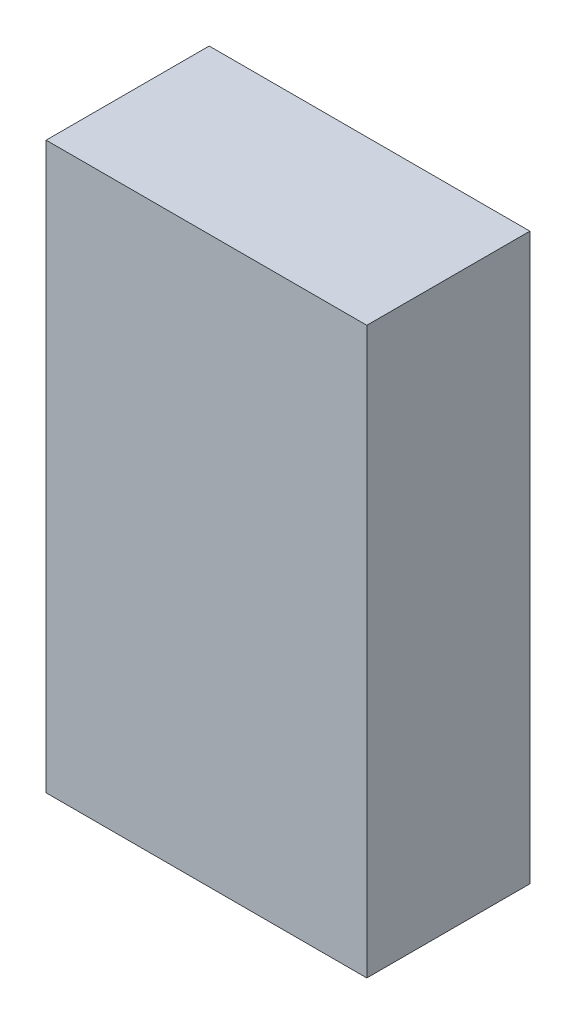
ISO-10303-21;
HEADER;
FILE_DESCRIPTION(('STEP AP214'),'2;1');
FILE_NAME('part.step','',(''),(''),'','','');
FILE_SCHEMA(('AUTOMOTIVE_DESIGN { 1 0 10303 214 1 1 1 1 }'));
ENDSEC;
DATA;
#1=APPLICATION_CONTEXT('core data for automotive mechanical design processes');
#2=APPLICATION_PROTOCOL_DEFINITION('international standard','automotive_design',2000,#1);
#3=PRODUCT_CONTEXT('',#1,'mechanical');
#4=PRODUCT('Part','Part','',(#3));
#5=PRODUCT_RELATED_PRODUCT_CATEGORY('part','',(#4));
#6=PRODUCT_DEFINITION_FORMATION('','',#4);
#7=PRODUCT_DEFINITION_CONTEXT('part definition',#1,'design');
#8=PRODUCT_DEFINITION('design','',#6,#7);
#9=PRODUCT_DEFINITION_SHAPE('','',#8);
#10=(LENGTH_UNIT() NAMED_UNIT(*) SI_UNIT(.MILLI.,.METRE.));
#11=(NAMED_UNIT(*) PLANE_ANGLE_UNIT() SI_UNIT($,.RADIAN.));
#12=(NAMED_UNIT(*) SI_UNIT($,.STERADIAN.) SOLID_ANGLE_UNIT());
#13=UNCERTAINTY_MEASURE_WITH_UNIT(LENGTH_MEASURE(1.E-05),#10,'distance_accuracy_value','');
#14=(GEOMETRIC_REPRESENTATION_CONTEXT(3) GLOBAL_UNCERTAINTY_ASSIGNED_CONTEXT((#13)) GLOBAL_UNIT_ASSIGNED_CONTEXT((#10,
#11,#12)) REPRESENTATION_CONTEXT('',''));
#15=CARTESIAN_POINT('',(0.,0.,0.));
#16=DIRECTION('',(0.,0.,1.));
#17=DIRECTION('',(1.,0.,0.));
#18=AXIS2_PLACEMENT_3D('',#15,#16,#17);
#19=CARTESIAN_POINT('',(-374.65,1320.8,190.5));
#20=DIRECTION('',(1.,0.,0.));
#21=DIRECTION('',(0.,0.,-1.));
#22=AXIS2_PLACEMENT_3D('',#19,#20,#21);
#23=PLANE('',#22);
#24=DIRECTION('',(0.,0.,1.));
#25=VECTOR('',#24,1.);
#26=CARTESIAN_POINT('',(-374.65,0.,190.5));
#27=LINE('',#26,#25);
#28=CARTESIAN_POINT('',(-374.65,0.,-190.5));
#29=VERTEX_POINT('',#28);
#30=CARTESIAN_POINT('',(-374.65,0.,190.5));
#31=VERTEX_POINT('',#30);
#32=EDGE_CURVE('E98',#29,#31,#27,.T.);
#33=ORIENTED_EDGE('',*,*,#32,.T.);
#34=DIRECTION('',(0.,-1.,0.));
#35=VECTOR('',#34,1.);
#36=CARTESIAN_POINT('',(-374.65,1320.8,190.5));
#37=LINE('',#36,#35);
#38=CARTESIAN_POINT('',(-374.65,1320.8,190.5));
#39=VERTEX_POINT('',#38);
#40=EDGE_CURVE('E11',#39,#31,#37,.T.);
#41=ORIENTED_EDGE('',*,*,#40,.F.);
#42=DIRECTION('',(0.,0.,1.));
#43=VECTOR('',#42,1.);
#44=CARTESIAN_POINT('',(-374.65,1320.8,190.5));
#45=LINE('',#44,#43);
#46=CARTESIAN_POINT('',(-374.65,1320.8,-190.5));
#47=VERTEX_POINT('',#46);
#48=EDGE_CURVE('E86',#47,#39,#45,.T.);
#49=ORIENTED_EDGE('',*,*,#48,.F.);
#50=DIRECTION('',(0.,-1.,0.));
#51=VECTOR('',#50,1.);
#52=CARTESIAN_POINT('',(-374.65,1320.8,-190.5));
#53=LINE('',#52,#51);
#54=EDGE_CURVE('E94',#47,#29,#53,.T.);
#55=ORIENTED_EDGE('',*,*,#54,.T.);
#56=EDGE_LOOP('',(#33,#41,#49,#55));
#57=FACE_BOUND('',#56,.T.);
#58=ADVANCED_FACE('F35',(#57),#23,.F.);
#59=CARTESIAN_POINT('',(374.65,1320.8,190.5));
#60=DIRECTION('',(0.,0.,-1.));
#61=DIRECTION('',(-1.,0.,0.));
#62=AXIS2_PLACEMENT_3D('',#59,#60,#61);
#63=PLANE('',#62);
#64=DIRECTION('',(1.,0.,0.));
#65=VECTOR('',#64,1.);
#66=CARTESIAN_POINT('',(374.65,0.,190.5));
#67=LINE('',#66,#65);
#68=CARTESIAN_POINT('',(374.65,0.,190.5));
#69=VERTEX_POINT('',#68);
#70=EDGE_CURVE('E90',#31,#69,#67,.T.);
#71=ORIENTED_EDGE('',*,*,#70,.T.);
#72=DIRECTION('',(0.,-1.,0.));
#73=VECTOR('',#72,1.);
#74=CARTESIAN_POINT('',(374.65,1320.8,190.5));
#75=LINE('',#74,#73);
#76=CARTESIAN_POINT('',(374.65,1320.8,190.5));
#77=VERTEX_POINT('',#76);
#78=EDGE_CURVE('E43',#77,#69,#75,.T.);
#79=ORIENTED_EDGE('',*,*,#78,.F.);
#80=DIRECTION('',(1.,0.,0.));
#81=VECTOR('',#80,1.);
#82=CARTESIAN_POINT('',(374.65,1320.8,190.5));
#83=LINE('',#82,#81);
#84=EDGE_CURVE('E81',#39,#77,#83,.T.);
#85=ORIENTED_EDGE('',*,*,#84,.F.);
#86=ORIENTED_EDGE('',*,*,#40,.T.);
#87=EDGE_LOOP('',(#71,#79,#85,#86));
#88=FACE_BOUND('',#87,.T.);
#89=ADVANCED_FACE('F89',(#88),#63,.F.);
#90=CARTESIAN_POINT('',(374.65,1320.8,190.5));
#91=DIRECTION('',(-1.,0.,0.));
#92=DIRECTION('',(0.,0.,1.));
#93=AXIS2_PLACEMENT_3D('',#90,#91,#92);
#94=PLANE('',#93);
#95=DIRECTION('',(0.,0.,-1.));
#96=VECTOR('',#95,1.);
#97=CARTESIAN_POINT('',(374.65,0.,190.5));
#98=LINE('',#97,#96);
#99=CARTESIAN_POINT('',(374.65,0.,-190.5));
#100=VERTEX_POINT('',#99);
#101=EDGE_CURVE('E68',#69,#100,#98,.T.);
#102=ORIENTED_EDGE('',*,*,#101,.T.);
#103=DIRECTION('',(0.,-1.,0.));
#104=VECTOR('',#103,1.);
#105=CARTESIAN_POINT('',(374.65,1320.8,-190.5));
#106=LINE('',#105,#104);
#107=CARTESIAN_POINT('',(374.65,1320.8,-190.5));
#108=VERTEX_POINT('',#107);
#109=EDGE_CURVE('E91',#108,#100,#106,.T.);
#110=ORIENTED_EDGE('',*,*,#109,.F.);
#111=DIRECTION('',(0.,0.,-1.));
#112=VECTOR('',#111,1.);
#113=CARTESIAN_POINT('',(374.65,1320.8,190.5));
#114=LINE('',#113,#112);
#115=EDGE_CURVE('E84',#77,#108,#114,.T.);
#116=ORIENTED_EDGE('',*,*,#115,.F.);
#117=ORIENTED_EDGE('',*,*,#78,.T.);
#118=EDGE_LOOP('',(#102,#110,#116,#117));
#119=FACE_BOUND('',#118,.T.);
#120=ADVANCED_FACE('F92',(#119),#94,.F.);
#121=CARTESIAN_POINT('',(374.65,1320.8,-190.5));
#122=DIRECTION('',(0.,0.,1.));
#123=DIRECTION('',(1.,0.,0.));
#124=AXIS2_PLACEMENT_3D('',#121,#122,#123);
#125=PLANE('',#124);
#126=DIRECTION('',(-1.,0.,0.));
#127=VECTOR('',#126,1.);
#128=CARTESIAN_POINT('',(374.65,0.,-190.5));
#129=LINE('',#128,#127);
#130=EDGE_CURVE('E74',#100,#29,#129,.T.);
#131=ORIENTED_EDGE('',*,*,#130,.T.);
#132=ORIENTED_EDGE('',*,*,#54,.F.);
#133=DIRECTION('',(-1.,0.,0.));
#134=VECTOR('',#133,1.);
#135=CARTESIAN_POINT('',(374.65,1320.8,-190.5));
#136=LINE('',#135,#134);
#137=EDGE_CURVE('E51',#108,#47,#136,.T.);
#138=ORIENTED_EDGE('',*,*,#137,.F.);
#139=ORIENTED_EDGE('',*,*,#109,.T.);
#140=EDGE_LOOP('',(#131,#132,#138,#139));
#141=FACE_BOUND('',#140,.T.);
#142=ADVANCED_FACE('F105',(#141),#125,.F.);
#143=CARTESIAN_POINT('',(0.,1320.8,0.));
#144=DIRECTION('',(0.,1.,0.));
#145=DIRECTION('',(0.,0.,1.));
#146=AXIS2_PLACEMENT_3D('',#143,#144,#145);
#147=PLANE('',#146);
#148=ORIENTED_EDGE('',*,*,#48,.T.);
#149=ORIENTED_EDGE('',*,*,#84,.T.);
#150=ORIENTED_EDGE('',*,*,#115,.T.);
#151=ORIENTED_EDGE('',*,*,#137,.T.);
#152=EDGE_LOOP('',(#148,#149,#150,#151));
#153=FACE_BOUND('',#152,.T.);
#154=ADVANCED_FACE('F82',(#153),#147,.T.);
#155=CARTESIAN_POINT('',(0.,0.,0.));
#156=DIRECTION('',(0.,1.,0.));
#157=DIRECTION('',(0.,0.,1.));
#158=AXIS2_PLACEMENT_3D('',#155,#156,#157);
#159=PLANE('',#158);
#160=ORIENTED_EDGE('',*,*,#32,.F.);
#161=ORIENTED_EDGE('',*,*,#130,.F.);
#162=ORIENTED_EDGE('',*,*,#101,.F.);
#163=ORIENTED_EDGE('',*,*,#70,.F.);
#164=EDGE_LOOP('',(#160,#161,#162,#163));
#165=FACE_BOUND('',#164,.T.);
#166=ADVANCED_FACE('F108',(#165),#159,.F.);
#167=CLOSED_SHELL('',(#58,#89,#120,#142,#154,#166));
#168=MANIFOLD_SOLID_BREP('B2',#167);
#169=ADVANCED_BREP_SHAPE_REPRESENTATION('',(#18,#168),#14);
#170=SHAPE_DEFINITION_REPRESENTATION(#9,#169);
ENDSEC;
END-ISO-10303-21;
